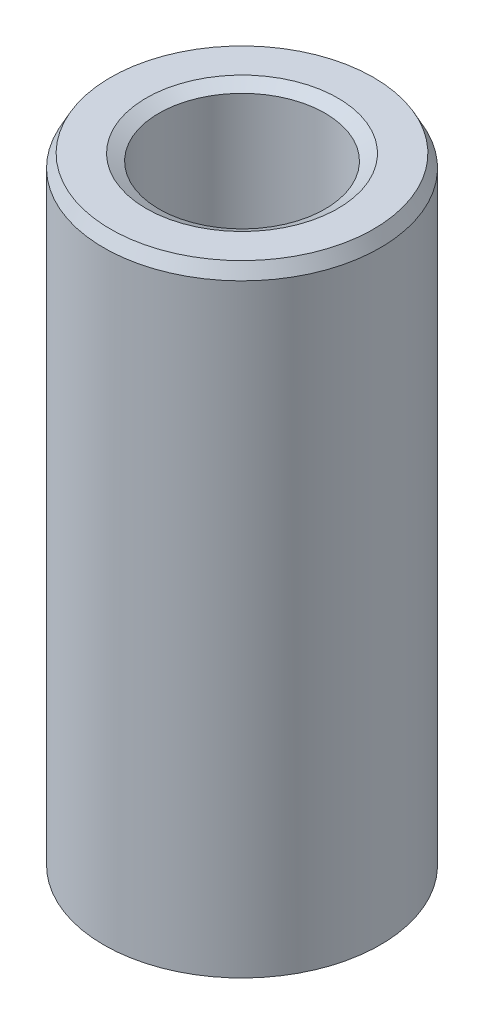
ISO-10303-21;
HEADER;
FILE_DESCRIPTION(('STEP AP214'),'2;1');
FILE_NAME('part.step','',(''),(''),'','','');
FILE_SCHEMA(('AUTOMOTIVE_DESIGN { 1 0 10303 214 1 1 1 1 }'));
ENDSEC;
DATA;
#1=APPLICATION_CONTEXT('core data for automotive mechanical design processes');
#2=APPLICATION_PROTOCOL_DEFINITION('international standard','automotive_design',2000,#1);
#3=PRODUCT_CONTEXT('',#1,'mechanical');
#4=PRODUCT('Part','Part','',(#3));
#5=PRODUCT_RELATED_PRODUCT_CATEGORY('part','',(#4));
#6=PRODUCT_DEFINITION_FORMATION('','',#4);
#7=PRODUCT_DEFINITION_CONTEXT('part definition',#1,'design');
#8=PRODUCT_DEFINITION('design','',#6,#7);
#9=PRODUCT_DEFINITION_SHAPE('','',#8);
#10=(LENGTH_UNIT() NAMED_UNIT(*) SI_UNIT(.MILLI.,.METRE.));
#11=(NAMED_UNIT(*) PLANE_ANGLE_UNIT() SI_UNIT($,.RADIAN.));
#12=(NAMED_UNIT(*) SI_UNIT($,.STERADIAN.) SOLID_ANGLE_UNIT());
#13=UNCERTAINTY_MEASURE_WITH_UNIT(LENGTH_MEASURE(1.E-05),#10,'distance_accuracy_value','');
#14=(GEOMETRIC_REPRESENTATION_CONTEXT(3) GLOBAL_UNCERTAINTY_ASSIGNED_CONTEXT((#13)) GLOBAL_UNIT_ASSIGNED_CONTEXT((#10,
#11,#12)) REPRESENTATION_CONTEXT('',''));
#15=CARTESIAN_POINT('',(0.,0.,0.));
#16=DIRECTION('',(0.,0.,1.));
#17=DIRECTION('',(1.,0.,0.));
#18=AXIS2_PLACEMENT_3D('',#15,#16,#17);
#19=CARTESIAN_POINT('',(0.,90.1627540730445,0.));
#20=DIRECTION('',(0.,-1.,0.));
#21=DIRECTION('',(0.,0.,-1.));
#22=AXIS2_PLACEMENT_3D('',#19,#20,#21);
#23=CYLINDRICAL_SURFACE('',#22,20.);
#24=CARTESIAN_POINT('',(0.,0.980555779859921,0.));
#25=DIRECTION('',(0.,1.,0.));
#26=DIRECTION('',(0.,0.,1.));
#27=AXIS2_PLACEMENT_3D('',#24,#25,#26);
#28=CIRCLE('',#27,20.);
#29=CARTESIAN_POINT('',(0.,0.980555779859921,20.));
#30=VERTEX_POINT('',#29);
#31=EDGE_CURVE('E10',#30,#30,#28,.T.);
#32=ORIENTED_EDGE('',*,*,#31,.T.);
#33=EDGE_LOOP('',(#32));
#34=FACE_BOUND('',#33,.T.);
#35=CARTESIAN_POINT('',(0.,88.3179003510876,0.));
#36=DIRECTION('',(0.,1.,0.));
#37=DIRECTION('',(0.,0.,1.));
#38=AXIS2_PLACEMENT_3D('',#35,#36,#37);
#39=CIRCLE('',#38,20.);
#40=CARTESIAN_POINT('',(0.,88.3179003510875,-20.));
#41=VERTEX_POINT('',#40);
#42=EDGE_CURVE('E50',#41,#41,#39,.F.);
#43=ORIENTED_EDGE('',*,*,#42,.T.);
#44=EDGE_LOOP('',(#43));
#45=FACE_BOUND('',#44,.T.);
#46=ADVANCED_FACE('F39',(#34,#45),#23,.T.);
#47=CARTESIAN_POINT('',(0.,90.1627540730445,0.));
#48=DIRECTION('',(0.,1.,0.));
#49=DIRECTION('',(0.,0.,1.));
#50=AXIS2_PLACEMENT_3D('',#47,#48,#49);
#51=PLANE('',#50);
#52=CARTESIAN_POINT('',(0.,90.1627540730445,0.));
#53=DIRECTION('',(0.,1.,0.));
#54=DIRECTION('',(0.,0.,1.));
#55=AXIS2_PLACEMENT_3D('',#52,#53,#54);
#56=CIRCLE('',#55,13.8615479585601);
#57=CARTESIAN_POINT('',(0.,90.1627540730445,13.8615479585601));
#58=VERTEX_POINT('',#57);
#59=EDGE_CURVE('E58',#58,#58,#56,.F.);
#60=ORIENTED_EDGE('',*,*,#59,.T.);
#61=EDGE_LOOP('',(#60));
#62=FACE_BOUND('',#61,.T.);
#63=CARTESIAN_POINT('',(0.,90.1627540730445,0.));
#64=DIRECTION('',(0.,1.,0.));
#65=DIRECTION('',(0.,0.,1.));
#66=AXIS2_PLACEMENT_3D('',#63,#64,#65);
#67=CIRCLE('',#66,19.0194442201401);
#68=CARTESIAN_POINT('',(0.,90.1627540730445,-19.0194442201401));
#69=VERTEX_POINT('',#68);
#70=EDGE_CURVE('E61',#69,#69,#67,.T.);
#71=ORIENTED_EDGE('',*,*,#70,.T.);
#72=EDGE_LOOP('',(#71));
#73=FACE_BOUND('',#72,.T.);
#74=ADVANCED_FACE('F88',(#62,#73),#51,.T.);
#75=CARTESIAN_POINT('',(0.,0.,0.));
#76=DIRECTION('',(0.,1.,0.));
#77=DIRECTION('',(0.,0.,1.));
#78=AXIS2_PLACEMENT_3D('',#75,#76,#77);
#79=PLANE('',#78);
#80=CARTESIAN_POINT('',(0.,0.,0.));
#81=DIRECTION('',(0.,1.,0.));
#82=DIRECTION('',(0.,0.,1.));
#83=AXIS2_PLACEMENT_3D('',#80,#81,#82);
#84=CIRCLE('',#83,12.997250016463);
#85=CARTESIAN_POINT('',(0.,0.,-12.997250016463));
#86=VERTEX_POINT('',#85);
#87=EDGE_CURVE('E51',#86,#86,#84,.T.);
#88=ORIENTED_EDGE('',*,*,#87,.T.);
#89=EDGE_LOOP('',(#88));
#90=FACE_BOUND('',#89,.T.);
#91=CARTESIAN_POINT('',(0.,0.,0.));
#92=DIRECTION('',(0.,1.,0.));
#93=DIRECTION('',(0.,0.,1.));
#94=AXIS2_PLACEMENT_3D('',#91,#92,#93);
#95=CIRCLE('',#94,18.155146278043);
#96=CARTESIAN_POINT('',(0.,0.,18.155146278043));
#97=VERTEX_POINT('',#96);
#98=EDGE_CURVE('E54',#97,#97,#95,.F.);
#99=ORIENTED_EDGE('',*,*,#98,.T.);
#100=EDGE_LOOP('',(#99));
#101=FACE_BOUND('',#100,.T.);
#102=ADVANCED_FACE('F83',(#90,#101),#79,.F.);
#103=CARTESIAN_POINT('',(0.,90.1627540730445,0.));
#104=DIRECTION('',(0.,-1.,0.));
#105=DIRECTION('',(0.,0.,-1.));
#106=AXIS2_PLACEMENT_3D('',#103,#104,#105);
#107=CYLINDRICAL_SURFACE('',#106,12.0166942366031);
#108=CARTESIAN_POINT('',(0.,89.1821982931846,0.));
#109=DIRECTION('',(0.,1.,0.));
#110=DIRECTION('',(0.,0.,1.));
#111=AXIS2_PLACEMENT_3D('',#108,#109,#110);
#112=CIRCLE('',#111,12.0166942366031);
#113=CARTESIAN_POINT('',(0.,89.1821982931846,12.0166942366031));
#114=VERTEX_POINT('',#113);
#115=EDGE_CURVE('E67',#114,#114,#112,.T.);
#116=ORIENTED_EDGE('',*,*,#115,.T.);
#117=EDGE_LOOP('',(#116));
#118=FACE_BOUND('',#117,.T.);
#119=CARTESIAN_POINT('',(0.,1.84485372195697,0.));
#120=DIRECTION('',(0.,1.,0.));
#121=DIRECTION('',(0.,0.,1.));
#122=AXIS2_PLACEMENT_3D('',#119,#120,#121);
#123=CIRCLE('',#122,12.0166942366031);
#124=CARTESIAN_POINT('',(0.,1.84485372195697,-12.0166942366031));
#125=VERTEX_POINT('',#124);
#126=EDGE_CURVE('E69',#125,#125,#123,.F.);
#127=ORIENTED_EDGE('',*,*,#126,.T.);
#128=EDGE_LOOP('',(#127));
#129=FACE_BOUND('',#128,.T.);
#130=ADVANCED_FACE('F71',(#118,#129),#107,.F.);
#131=CARTESIAN_POINT('',(0.,89.1821982931846,0.));
#132=DIRECTION('',(0.,1.,0.));
#133=DIRECTION('',(0.,0.,1.));
#134=AXIS2_PLACEMENT_3D('',#131,#132,#133);
#135=CONICAL_SURFACE('',#134,12.0166942366031,1.08226064891765);
#136=ORIENTED_EDGE('',*,*,#59,.F.);
#137=EDGE_LOOP('',(#136));
#138=FACE_BOUND('',#137,.T.);
#139=ORIENTED_EDGE('',*,*,#115,.F.);
#140=EDGE_LOOP('',(#139));
#141=FACE_BOUND('',#140,.T.);
#142=ADVANCED_FACE('F77',(#138,#141),#135,.F.);
#143=CARTESIAN_POINT('',(0.,0.,0.));
#144=DIRECTION('',(0.,-1.,0.));
#145=DIRECTION('',(0.,0.,-1.));
#146=AXIS2_PLACEMENT_3D('',#143,#144,#145);
#147=CONICAL_SURFACE('',#146,12.997250016463,0.488535677877238);
#148=CARTESIAN_POINT('',(0.,1.84485372195697,-12.0166942366031));
#149=CARTESIAN_POINT('',(0.,1.82563649568659,-12.02690835931));
#150=CARTESIAN_POINT('',(0.,1.8064192694162,-12.0371224820169));
#151=CARTESIAN_POINT('',(0.,1.76798481687543,-12.0575507274306));
#152=CARTESIAN_POINT('',(0.,1.74876759060505,-12.0677648501375));
#153=CARTESIAN_POINT('',(0.,1.71033313806428,-12.0881930955513));
#154=CARTESIAN_POINT('',(0.,1.69111591179389,-12.0984072182581));
#155=CARTESIAN_POINT('',(0.,1.65268145925312,-12.1188354636719));
#156=CARTESIAN_POINT('',(0.,1.63346423298274,-12.1290495863788));
#157=CARTESIAN_POINT('',(0.,1.59502978044197,-12.1494778317925));
#158=CARTESIAN_POINT('',(0.,1.57581255417158,-12.1596919544994));
#159=CARTESIAN_POINT('',(0.,1.53737810163081,-12.1801201999131));
#160=CARTESIAN_POINT('',(0.,1.51816087536043,-12.19033432262));
#161=CARTESIAN_POINT('',(0.,1.47972642281966,-12.2107625680337));
#162=CARTESIAN_POINT('',(0.,1.46050919654927,-12.2209766907406));
#163=CARTESIAN_POINT('',(0.,1.4220747440085,-12.2414049361544));
#164=CARTESIAN_POINT('',(0.,1.40285751773812,-12.2516190588612));
#165=CARTESIAN_POINT('',(0.,1.36442306519735,-12.272047304275));
#166=CARTESIAN_POINT('',(0.,1.34520583892696,-12.2822614269819));
#167=CARTESIAN_POINT('',(0.,1.30677138638619,-12.3026896723956));
#168=CARTESIAN_POINT('',(0.,1.2875541601158,-12.3129037951025));
#169=CARTESIAN_POINT('',(0.,1.24911970757503,-12.3333320405162));
#170=CARTESIAN_POINT('',(0.,1.22990248130465,-12.3435461632231));
#171=CARTESIAN_POINT('',(0.,1.19146802876388,-12.3639744086369));
#172=CARTESIAN_POINT('',(0.,1.17225080249349,-12.3741885313437));
#173=CARTESIAN_POINT('',(0.,1.13381634995272,-12.3946167767575));
#174=CARTESIAN_POINT('',(0.,1.11459912368234,-12.4048308994644));
#175=CARTESIAN_POINT('',(0.,1.07616467114157,-12.4252591448781));
#176=CARTESIAN_POINT('',(0.,1.05694744487118,-12.435473267585));
#177=CARTESIAN_POINT('',(0.,1.01851299233041,-12.4559015129987));
#178=CARTESIAN_POINT('',(0.,0.999295766060027,-12.4661156357056));
#179=CARTESIAN_POINT('',(0.,0.960861313519257,-12.4865438811193));
#180=CARTESIAN_POINT('',(0.,0.941644087248872,-12.4967580038262));
#181=CARTESIAN_POINT('',(0.,0.903209634708102,-12.51718624924));
#182=CARTESIAN_POINT('',(0.,0.883992408437717,-12.5274003719468));
#183=CARTESIAN_POINT('',(0.,0.845557955896946,-12.5478286173606));
#184=CARTESIAN_POINT('',(0.,0.826340729626561,-12.5580427400675));
#185=CARTESIAN_POINT('',(0.,0.787906277085791,-12.5784709854812));
#186=CARTESIAN_POINT('',(0.,0.768689050815406,-12.5886851081881));
#187=CARTESIAN_POINT('',(0.,0.730254598274635,-12.6091133536018));
#188=CARTESIAN_POINT('',(0.,0.71103737200425,-12.6193274763087));
#189=CARTESIAN_POINT('',(0.,0.67260291946348,-12.6397557217225));
#190=CARTESIAN_POINT('',(0.,0.653385693193095,-12.6499698444293));
#191=CARTESIAN_POINT('',(0.,0.614951240652324,-12.6703980898431));
#192=CARTESIAN_POINT('',(0.,0.595734014381939,-12.68061221255));
#193=CARTESIAN_POINT('',(0.,0.557299561841169,-12.7010404579637));
#194=CARTESIAN_POINT('',(0.,0.538082335570784,-12.7112545806706));
#195=CARTESIAN_POINT('',(0.,0.499647883030014,-12.7316828260843));
#196=CARTESIAN_POINT('',(0.,0.480430656759628,-12.7418969487912));
#197=CARTESIAN_POINT('',(0.,0.441996204218858,-12.7623251942049));
#198=CARTESIAN_POINT('',(0.,0.422778977948473,-12.7725393169118));
#199=CARTESIAN_POINT('',(0.,0.384344525407703,-12.7929675623256));
#200=CARTESIAN_POINT('',(0.,0.365127299137318,-12.8031816850324));
#201=CARTESIAN_POINT('',(0.,0.326692846596547,-12.8236099304462));
#202=CARTESIAN_POINT('',(0.,0.307475620326162,-12.8338240531531));
#203=CARTESIAN_POINT('',(0.,0.269041167785392,-12.8542522985668));
#204=CARTESIAN_POINT('',(0.,0.249823941515007,-12.8644664212737));
#205=CARTESIAN_POINT('',(0.,0.211389488974237,-12.8848946666874));
#206=CARTESIAN_POINT('',(0.,0.192172262703851,-12.8951087893943));
#207=CARTESIAN_POINT('',(0.,0.153737810163081,-12.9155370348081));
#208=CARTESIAN_POINT('',(0.,0.134520583892696,-12.9257511575149));
#209=CARTESIAN_POINT('',(0.,0.0960861313519256,-12.9461794029287));
#210=CARTESIAN_POINT('',(0.,0.0768689050815406,-12.9563935256356));
#211=CARTESIAN_POINT('',(0.,0.0384344525407705,-12.9768217710493));
#212=CARTESIAN_POINT('',(0.,0.0192172262703855,-12.9870358937562));
#213=CARTESIAN_POINT('',(0.,0.,-12.997250016463));
#214=B_SPLINE_CURVE_WITH_KNOTS('',3,(#148,#149,#150,#151,#152,#153,#154,#155,#156,#157,#158,
#159,#160,#161,#162,#163,#164,#165,#166,#167,#168,#169,#170,#171,#172,#173,#174,#175,#176,#177,
#178,#179,#180,#181,#182,#183,#184,#185,#186,#187,#188,#189,#190,#191,#192,#193,#194,#195,#196,
#197,#198,#199,#200,#201,#202,#203,#204,#205,#206,#207,#208,#209,#210,#211,#212,#213),
.UNSPECIFIED.,.F.,.F.,(4,2,2,2,2,2,2,2,2,2,2,2,2,2,2,2,2,2,2,2,2,2,2,2,2,2,2,2,2,2,2,2,4),(0.,
0.065289132279303,0.130578264558607,0.19586739683791,0.261156529117213,0.326445661396516,
0.391734793675819,0.457023925955122,0.522313058234426,0.587602190513729,0.652891322793032,
0.718180455072336,0.783469587351639,0.848758719630942,0.914047851910245,0.979336984189548,
1.04462611646885,1.10991524874815,1.17520438102746,1.24049351330676,1.30578264558606,
1.37107177786537,1.43636091014467,1.50165004242397,1.56693917470328,1.63222830698258,
1.69751743926188,1.76280657154119,1.82809570382049,1.89338483609979,1.9586739683791,
2.0239631006584,2.0892522329377),.UNSPECIFIED.);
#215=EDGE_CURVE('BSEAM73',#125,#86,#214,.T.);
#216=ORIENTED_EDGE('',*,*,#126,.F.);
#217=ORIENTED_EDGE('',*,*,#87,.F.);
#218=ORIENTED_EDGE('',*,*,#215,.T.);
#219=ORIENTED_EDGE('',*,*,#215,.F.);
#220=EDGE_LOOP('',(#216,#218,#217,#219));
#221=FACE_BOUND('',#220,.T.);
#222=ADVANCED_FACE('F73',(#221),#147,.F.);
#223=CARTESIAN_POINT('',(0.,0.980555779859921,0.));
#224=DIRECTION('',(0.,1.,0.));
#225=DIRECTION('',(0.,0.,1.));
#226=AXIS2_PLACEMENT_3D('',#223,#224,#225);
#227=CONICAL_SURFACE('',#226,20.,1.08226064891766);
#228=ORIENTED_EDGE('',*,*,#98,.F.);
#229=EDGE_LOOP('',(#228));
#230=FACE_BOUND('',#229,.T.);
#231=ORIENTED_EDGE('',*,*,#31,.F.);
#232=EDGE_LOOP('',(#231));
#233=FACE_BOUND('',#232,.T.);
#234=ADVANCED_FACE('F76',(#230,#233),#227,.T.);
#235=CARTESIAN_POINT('',(0.,90.1627540730445,0.));
#236=DIRECTION('',(0.,-1.,0.));
#237=DIRECTION('',(0.,0.,-1.));
#238=AXIS2_PLACEMENT_3D('',#235,#236,#237);
#239=CONICAL_SURFACE('',#238,19.0194442201401,0.488535677877241);
#240=CARTESIAN_POINT('',(0.,88.3179003510875,-20.));
#241=CARTESIAN_POINT('',(0.,88.3371175773579,-19.9897858772931));
#242=CARTESIAN_POINT('',(0.,88.3563348036283,-19.9795717545863));
#243=CARTESIAN_POINT('',(0.,88.3947692561691,-19.9591435091725));
#244=CARTESIAN_POINT('',(0.,88.4139864824395,-19.9489293864656));
#245=CARTESIAN_POINT('',(0.,88.4524209349802,-19.9285011410519));
#246=CARTESIAN_POINT('',(0.,88.4716381612506,-19.918287018345));
#247=CARTESIAN_POINT('',(0.,88.5100726137914,-19.8978587729313));
#248=CARTESIAN_POINT('',(0.,88.5292898400618,-19.8876446502244));
#249=CARTESIAN_POINT('',(0.,88.5677242926025,-19.8672164048106));
#250=CARTESIAN_POINT('',(0.,88.5869415188729,-19.8570022821038));
#251=CARTESIAN_POINT('',(0.,88.6253759714137,-19.83657403669));
#252=CARTESIAN_POINT('',(0.,88.6445931976841,-19.8263599139831));
#253=CARTESIAN_POINT('',(0.,88.6830276502249,-19.8059316685694));
#254=CARTESIAN_POINT('',(0.,88.7022448764953,-19.7957175458625));
#255=CARTESIAN_POINT('',(0.,88.740679329036,-19.7752893004488));
#256=CARTESIAN_POINT('',(0.,88.7598965553064,-19.7650751777419));
#257=CARTESIAN_POINT('',(0.,88.7983310078472,-19.7446469323281));
#258=CARTESIAN_POINT('',(0.,88.8175482341176,-19.7344328096213));
#259=CARTESIAN_POINT('',(0.,88.8559826866583,-19.7140045642075));
#260=CARTESIAN_POINT('',(0.,88.8751999129287,-19.7037904415007));
#261=CARTESIAN_POINT('',(0.,88.9136343654695,-19.6833621960869));
#262=CARTESIAN_POINT('',(0.,88.9328515917399,-19.67314807338));
#263=CARTESIAN_POINT('',(0.,88.9712860442806,-19.6527198279663));
#264=CARTESIAN_POINT('',(0.,88.990503270551,-19.6425057052594));
#265=CARTESIAN_POINT('',(0.,89.0289377230918,-19.6220774598457));
#266=CARTESIAN_POINT('',(0.,89.0481549493622,-19.6118633371388));
#267=CARTESIAN_POINT('',(0.,89.086589401903,-19.591435091725));
#268=CARTESIAN_POINT('',(0.,89.1058066281733,-19.5812209690182));
#269=CARTESIAN_POINT('',(0.,89.1442410807141,-19.5607927236044));
#270=CARTESIAN_POINT('',(0.,89.1634583069845,-19.5505786008975));
#271=CARTESIAN_POINT('',(0.,89.2018927595253,-19.5301503554838));
#272=CARTESIAN_POINT('',(0.,89.2211099857956,-19.5199362327769));
#273=CARTESIAN_POINT('',(0.,89.2595444383364,-19.4995079873632));
#274=CARTESIAN_POINT('',(0.,89.2787616646068,-19.4892938646563));
#275=CARTESIAN_POINT('',(0.,89.3171961171476,-19.4688656192425));
#276=CARTESIAN_POINT('',(0.,89.336413343418,-19.4586514965357));
#277=CARTESIAN_POINT('',(0.,89.3748477959587,-19.4382232511219));
#278=CARTESIAN_POINT('',(0.,89.3940650222291,-19.4280091284151));
#279=CARTESIAN_POINT('',(0.,89.4324994747699,-19.4075808830013));
#280=CARTESIAN_POINT('',(0.,89.4517167010403,-19.3973667602944));
#281=CARTESIAN_POINT('',(0.,89.490151153581,-19.3769385148807));
#282=CARTESIAN_POINT('',(0.,89.5093683798514,-19.3667243921738));
#283=CARTESIAN_POINT('',(0.,89.5478028323922,-19.3462961467601));
#284=CARTESIAN_POINT('',(0.,89.5670200586626,-19.3360820240532));
#285=CARTESIAN_POINT('',(0.,89.6054545112033,-19.3156537786394));
#286=CARTESIAN_POINT('',(0.,89.6246717374737,-19.3054396559326));
#287=CARTESIAN_POINT('',(0.,89.6631061900145,-19.2850114105188));
#288=CARTESIAN_POINT('',(0.,89.6823234162849,-19.2747972878119));
#289=CARTESIAN_POINT('',(0.,89.7207578688257,-19.2543690423982));
#290=CARTESIAN_POINT('',(0.,89.7399750950961,-19.2441549196913));
#291=CARTESIAN_POINT('',(0.,89.7784095476368,-19.2237266742776));
#292=CARTESIAN_POINT('',(0.,89.7976267739072,-19.2135125515707));
#293=CARTESIAN_POINT('',(0.,89.836061226448,-19.1930843061569));
#294=CARTESIAN_POINT('',(0.,89.8552784527184,-19.1828701834501));
#295=CARTESIAN_POINT('',(0.,89.8937129052591,-19.1624419380363));
#296=CARTESIAN_POINT('',(0.,89.9129301315295,-19.1522278153295));
#297=CARTESIAN_POINT('',(0.,89.9513645840703,-19.1317995699157));
#298=CARTESIAN_POINT('',(0.,89.9705818103407,-19.1215854472088));
#299=CARTESIAN_POINT('',(0.,90.0090162628814,-19.1011572017951));
#300=CARTESIAN_POINT('',(0.,90.0282334891518,-19.0909430790882));
#301=CARTESIAN_POINT('',(0.,90.0666679416926,-19.0705148336745));
#302=CARTESIAN_POINT('',(0.,90.085885167963,-19.0603007109676));
#303=CARTESIAN_POINT('',(0.,90.1243196205038,-19.0398724655538));
#304=CARTESIAN_POINT('',(0.,90.1435368467741,-19.029658342847));
#305=CARTESIAN_POINT('',(0.,90.1627540730445,-19.0194442201401));
#306=B_SPLINE_CURVE_WITH_KNOTS('',3,(#240,#241,#242,#243,#244,#245,#246,#247,#248,#249,#250,
#251,#252,#253,#254,#255,#256,#257,#258,#259,#260,#261,#262,#263,#264,#265,#266,#267,#268,#269,
#270,#271,#272,#273,#274,#275,#276,#277,#278,#279,#280,#281,#282,#283,#284,#285,#286,#287,#288,
#289,#290,#291,#292,#293,#294,#295,#296,#297,#298,#299,#300,#301,#302,#303,#304,#305),
.UNSPECIFIED.,.F.,.F.,(4,2,2,2,2,2,2,2,2,2,2,2,2,2,2,2,2,2,2,2,2,2,2,2,2,2,2,2,2,2,2,2,4),(0.,
0.0652891322793121,0.130578264558612,0.195867396837914,0.261156529117213,0.326445661396526,
0.391734793675825,0.457023925955125,0.522313058234427,0.587602190513739,0.652891322793039,
0.718180455072339,0.78346958735164,0.848758719630952,0.914047851910252,0.979336984189552,
1.04462611646885,1.10991524874817,1.17520438102747,1.24049351330677,1.30578264558607,
1.37107177786538,1.43636091014468,1.50165004242398,1.56693917470329,1.63222830698259,
1.69751743926189,1.76280657154119,1.82809570382051,1.89338483609981,1.95867396837911,
2.02396310065841,2.08925223293772),.UNSPECIFIED.);
#307=EDGE_CURVE('BSEAM45',#41,#69,#306,.T.);
#308=ORIENTED_EDGE('',*,*,#42,.F.);
#309=ORIENTED_EDGE('',*,*,#70,.F.);
#310=ORIENTED_EDGE('',*,*,#307,.T.);
#311=ORIENTED_EDGE('',*,*,#307,.F.);
#312=EDGE_LOOP('',(#308,#310,#309,#311));
#313=FACE_BOUND('',#312,.T.);
#314=ADVANCED_FACE('F45',(#313),#239,.T.);
#315=CLOSED_SHELL('',(#46,#74,#102,#130,#142,#222,#234,#314));
#316=MANIFOLD_SOLID_BREP('B2',#315);
#317=ADVANCED_BREP_SHAPE_REPRESENTATION('',(#18,#316),#14);
#318=SHAPE_DEFINITION_REPRESENTATION(#9,#317);
ENDSEC;
END-ISO-10303-21;
